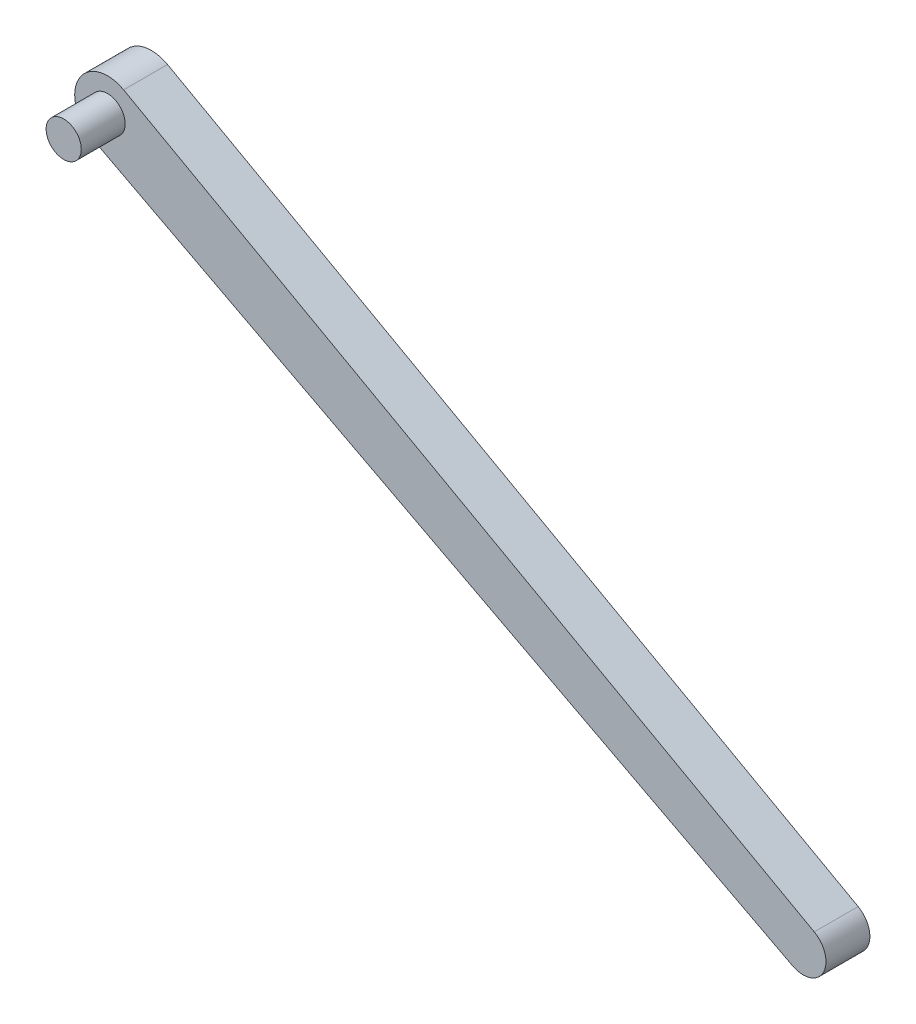
ISO-10303-21;
HEADER;
FILE_DESCRIPTION(('STEP AP214'),'2;1');
FILE_NAME('part.step','',(''),(''),'','','');
FILE_SCHEMA(('AUTOMOTIVE_DESIGN { 1 0 10303 214 1 1 1 1 }'));
ENDSEC;
DATA;
#1=APPLICATION_CONTEXT('core data for automotive mechanical design processes');
#2=APPLICATION_PROTOCOL_DEFINITION('international standard','automotive_design',2000,#1);
#3=PRODUCT_CONTEXT('',#1,'mechanical');
#4=PRODUCT('Part','Part','',(#3));
#5=PRODUCT_RELATED_PRODUCT_CATEGORY('part','',(#4));
#6=PRODUCT_DEFINITION_FORMATION('','',#4);
#7=PRODUCT_DEFINITION_CONTEXT('part definition',#1,'design');
#8=PRODUCT_DEFINITION('design','',#6,#7);
#9=PRODUCT_DEFINITION_SHAPE('','',#8);
#10=(LENGTH_UNIT() NAMED_UNIT(*) SI_UNIT(.MILLI.,.METRE.));
#11=(NAMED_UNIT(*) PLANE_ANGLE_UNIT() SI_UNIT($,.RADIAN.));
#12=(NAMED_UNIT(*) SI_UNIT($,.STERADIAN.) SOLID_ANGLE_UNIT());
#13=UNCERTAINTY_MEASURE_WITH_UNIT(LENGTH_MEASURE(1.E-05),#10,'distance_accuracy_value','');
#14=(GEOMETRIC_REPRESENTATION_CONTEXT(3) GLOBAL_UNCERTAINTY_ASSIGNED_CONTEXT((#13)) GLOBAL_UNIT_ASSIGNED_CONTEXT((#10,
#11,#12)) REPRESENTATION_CONTEXT('',''));
#15=CARTESIAN_POINT('',(0.,0.,0.));
#16=DIRECTION('',(0.,0.,1.));
#17=DIRECTION('',(1.,0.,0.));
#18=AXIS2_PLACEMENT_3D('',#15,#16,#17);
#19=CARTESIAN_POINT('',(0.,0.,-20.));
#20=DIRECTION('',(0.,0.,-1.));
#21=DIRECTION('',(1.,0.,0.));
#22=AXIS2_PLACEMENT_3D('',#19,#20,#21);
#23=PLANE('',#22);
#24=DIRECTION('',(0.874031845170728,-0.485868638242327,0.));
#25=VECTOR('',#24,1.);
#26=CARTESIAN_POINT('',(-43.5696519386731,-78.3776936399255,-20.));
#27=LINE('',#26,#25);
#28=CARTESIAN_POINT('',(-196.355985213183,6.55523883878045,-20.));
#29=VERTEX_POINT('',#28);
#30=CARTESIAN_POINT('',(-39.0430632462077,-80.8939949578273,-20.));
#31=VERTEX_POINT('',#30);
#32=EDGE_CURVE('E102',#29,#31,#27,.T.);
#33=ORIENTED_EDGE('',*,*,#32,.F.);
#34=CARTESIAN_POINT('',(-200.,0.,-20.));
#35=DIRECTION('',(0.,0.,1.));
#36=DIRECTION('',(1.,0.,0.));
#37=AXIS2_PLACEMENT_3D('',#34,#35,#36);
#38=CIRCLE('',#37,7.50000000000001);
#39=CARTESIAN_POINT('',(-203.47553922466,-6.64609863738495,-20.));
#40=VERTEX_POINT('',#39);
#41=EDGE_CURVE('E105',#29,#40,#38,.T.);
#42=ORIENTED_EDGE('',*,*,#41,.T.);
#43=DIRECTION('',(0.886146484984656,-0.463405229954668,0.));
#44=VECTOR('',#43,1.);
#45=CARTESIAN_POINT('',(-46.4244206545278,-88.775081766952,-20.));
#46=LINE('',#45,#44);
#47=CARTESIAN_POINT('',(-43.9821596482325,-90.0522481749993,-20.));
#48=VERTEX_POINT('',#47);
#49=EDGE_CURVE('E88',#40,#48,#46,.T.);
#50=ORIENTED_EDGE('',*,*,#49,.T.);
#51=CARTESIAN_POINT('',(-41.5710502933571,-85.441605174821,-20.));
#52=DIRECTION('',(0.,0.,1.));
#53=DIRECTION('',(1.,0.,0.));
#54=AXIS2_PLACEMENT_3D('',#51,#52,#53);
#55=CIRCLE('',#54,5.20302577316901);
#56=EDGE_CURVE('E97',#48,#31,#55,.T.);
#57=ORIENTED_EDGE('',*,*,#56,.T.);
#58=EDGE_LOOP('',(#33,#42,#50,#57));
#59=FACE_BOUND('',#58,.T.);
#60=CARTESIAN_POINT('',(-200.,0.,-20.));
#61=DIRECTION('',(0.,0.,1.));
#62=DIRECTION('',(1.,0.,0.));
#63=AXIS2_PLACEMENT_3D('',#60,#61,#62);
#64=CIRCLE('',#63,3.99999999999999);
#65=CARTESIAN_POINT('',(-196.,0.,-20.));
#66=VERTEX_POINT('',#65);
#67=EDGE_CURVE('E11',#66,#66,#64,.F.);
#68=ORIENTED_EDGE('',*,*,#67,.T.);
#69=EDGE_LOOP('',(#68));
#70=FACE_BOUND('',#69,.T.);
#71=ADVANCED_FACE('F35',(#59,#70),#23,.F.);
#72=CARTESIAN_POINT('',(-43.5696519386731,-78.3776936399255,-30.));
#73=DIRECTION('',(0.485868638242327,0.874031845170728,0.));
#74=DIRECTION('',(-0.874031845170728,0.485868638242327,0.));
#75=AXIS2_PLACEMENT_3D('',#72,#73,#74);
#76=PLANE('',#75);
#77=ORIENTED_EDGE('',*,*,#32,.T.);
#78=DIRECTION('',(0.,0.,1.));
#79=VECTOR('',#78,1.);
#80=CARTESIAN_POINT('',(-39.0430632462077,-80.8939949578273,-30.));
#81=LINE('',#80,#79);
#82=CARTESIAN_POINT('',(-39.0430632462077,-80.8939949578273,-30.));
#83=VERTEX_POINT('',#82);
#84=EDGE_CURVE('E72',#83,#31,#81,.T.);
#85=ORIENTED_EDGE('',*,*,#84,.F.);
#86=DIRECTION('',(0.874031845170728,-0.485868638242327,0.));
#87=VECTOR('',#86,1.);
#88=CARTESIAN_POINT('',(-43.5696519386731,-78.3776936399255,-30.));
#89=LINE('',#88,#87);
#90=CARTESIAN_POINT('',(-196.355985213183,6.55523883878045,-30.));
#91=VERTEX_POINT('',#90);
#92=EDGE_CURVE('E95',#91,#83,#89,.T.);
#93=ORIENTED_EDGE('',*,*,#92,.F.);
#94=DIRECTION('',(0.,0.,1.));
#95=VECTOR('',#94,1.);
#96=CARTESIAN_POINT('',(-196.355985213183,6.55523883878045,-30.));
#97=LINE('',#96,#95);
#98=EDGE_CURVE('E44',#91,#29,#97,.T.);
#99=ORIENTED_EDGE('',*,*,#98,.T.);
#100=EDGE_LOOP('',(#77,#85,#93,#99));
#101=FACE_BOUND('',#100,.T.);
#102=ADVANCED_FACE('F37',(#101),#76,.T.);
#103=CARTESIAN_POINT('',(-200.,0.,-30.));
#104=DIRECTION('',(0.,0.,1.));
#105=DIRECTION('',(-1.,0.,0.));
#106=AXIS2_PLACEMENT_3D('',#103,#104,#105);
#107=CYLINDRICAL_SURFACE('',#106,7.50000000000001);
#108=ORIENTED_EDGE('',*,*,#41,.F.);
#109=ORIENTED_EDGE('',*,*,#98,.F.);
#110=CARTESIAN_POINT('',(-200.,0.,-30.));
#111=DIRECTION('',(0.,0.,1.));
#112=DIRECTION('',(1.,0.,0.));
#113=AXIS2_PLACEMENT_3D('',#110,#111,#112);
#114=CIRCLE('',#113,7.50000000000001);
#115=CARTESIAN_POINT('',(-203.47553922466,-6.64609863738495,-30.));
#116=VERTEX_POINT('',#115);
#117=EDGE_CURVE('E79',#91,#116,#114,.T.);
#118=ORIENTED_EDGE('',*,*,#117,.T.);
#119=DIRECTION('',(0.,0.,1.));
#120=VECTOR('',#119,1.);
#121=CARTESIAN_POINT('',(-203.47553922466,-6.64609863738495,-30.));
#122=LINE('',#121,#120);
#123=EDGE_CURVE('E85',#116,#40,#122,.T.);
#124=ORIENTED_EDGE('',*,*,#123,.T.);
#125=EDGE_LOOP('',(#108,#109,#118,#124));
#126=FACE_BOUND('',#125,.T.);
#127=ADVANCED_FACE('F93',(#126),#107,.T.);
#128=CARTESIAN_POINT('',(-46.4244206545278,-88.775081766952,-30.));
#129=DIRECTION('',(0.463405229954668,0.886146484984656,0.));
#130=DIRECTION('',(-0.886146484984656,0.463405229954668,0.));
#131=AXIS2_PLACEMENT_3D('',#128,#129,#130);
#132=PLANE('',#131);
#133=ORIENTED_EDGE('',*,*,#49,.F.);
#134=ORIENTED_EDGE('',*,*,#123,.F.);
#135=DIRECTION('',(0.886146484984656,-0.463405229954668,0.));
#136=VECTOR('',#135,1.);
#137=CARTESIAN_POINT('',(-46.4244206545278,-88.775081766952,-30.));
#138=LINE('',#137,#136);
#139=CARTESIAN_POINT('',(-43.9821596482325,-90.0522481749993,-30.));
#140=VERTEX_POINT('',#139);
#141=EDGE_CURVE('E81',#116,#140,#138,.T.);
#142=ORIENTED_EDGE('',*,*,#141,.T.);
#143=DIRECTION('',(0.,0.,1.));
#144=VECTOR('',#143,1.);
#145=CARTESIAN_POINT('',(-43.9821596482325,-90.0522481749993,-30.));
#146=LINE('',#145,#144);
#147=EDGE_CURVE('E68',#140,#48,#146,.T.);
#148=ORIENTED_EDGE('',*,*,#147,.T.);
#149=EDGE_LOOP('',(#133,#134,#142,#148));
#150=FACE_BOUND('',#149,.T.);
#151=ADVANCED_FACE('F86',(#150),#132,.F.);
#152=CARTESIAN_POINT('',(-41.5710502933571,-85.441605174821,-30.));
#153=DIRECTION('',(0.,0.,1.));
#154=DIRECTION('',(-1.,0.,0.));
#155=AXIS2_PLACEMENT_3D('',#152,#153,#154);
#156=CYLINDRICAL_SURFACE('',#155,5.20302577316901);
#157=ORIENTED_EDGE('',*,*,#56,.F.);
#158=ORIENTED_EDGE('',*,*,#147,.F.);
#159=CARTESIAN_POINT('',(-41.5710502933571,-85.441605174821,-30.));
#160=DIRECTION('',(0.,0.,1.));
#161=DIRECTION('',(1.,0.,0.));
#162=AXIS2_PLACEMENT_3D('',#159,#160,#161);
#163=CIRCLE('',#162,5.20302577316901);
#164=EDGE_CURVE('E52',#140,#83,#163,.T.);
#165=ORIENTED_EDGE('',*,*,#164,.T.);
#166=ORIENTED_EDGE('',*,*,#84,.T.);
#167=EDGE_LOOP('',(#157,#158,#165,#166));
#168=FACE_BOUND('',#167,.T.);
#169=ADVANCED_FACE('F115',(#168),#156,.T.);
#170=CARTESIAN_POINT('',(0.,0.,-30.));
#171=DIRECTION('',(0.,0.,-1.));
#172=DIRECTION('',(1.,0.,0.));
#173=AXIS2_PLACEMENT_3D('',#170,#171,#172);
#174=PLANE('',#173);
#175=ORIENTED_EDGE('',*,*,#92,.T.);
#176=ORIENTED_EDGE('',*,*,#164,.F.);
#177=ORIENTED_EDGE('',*,*,#141,.F.);
#178=ORIENTED_EDGE('',*,*,#117,.F.);
#179=EDGE_LOOP('',(#175,#176,#177,#178));
#180=FACE_BOUND('',#179,.T.);
#181=ADVANCED_FACE('F83',(#180),#174,.T.);
#182=CARTESIAN_POINT('',(-200.,0.,-10.));
#183=DIRECTION('',(0.,0.,-1.));
#184=DIRECTION('',(1.,0.,0.));
#185=AXIS2_PLACEMENT_3D('',#182,#183,#184);
#186=CYLINDRICAL_SURFACE('',#185,3.99999999999999);
#187=CARTESIAN_POINT('',(-200.,0.,-10.));
#188=DIRECTION('',(0.,0.,-1.));
#189=DIRECTION('',(-1.,0.,0.));
#190=AXIS2_PLACEMENT_3D('',#187,#188,#189);
#191=CIRCLE('',#190,3.99999999999999);
#192=CARTESIAN_POINT('',(-204.,0.,-10.));
#193=VERTEX_POINT('',#192);
#194=EDGE_CURVE('E106',#193,#193,#191,.T.);
#195=ORIENTED_EDGE('',*,*,#194,.T.);
#196=EDGE_LOOP('',(#195));
#197=FACE_BOUND('',#196,.T.);
#198=ORIENTED_EDGE('',*,*,#67,.F.);
#199=EDGE_LOOP('',(#198));
#200=FACE_BOUND('',#199,.T.);
#201=ADVANCED_FACE('F122',(#197,#200),#186,.T.);
#202=CARTESIAN_POINT('',(-200.,0.,-10.));
#203=DIRECTION('',(0.,0.,1.));
#204=DIRECTION('',(-1.,0.,0.));
#205=AXIS2_PLACEMENT_3D('',#202,#203,#204);
#206=PLANE('',#205);
#207=ORIENTED_EDGE('',*,*,#194,.F.);
#208=EDGE_LOOP('',(#207));
#209=FACE_BOUND('',#208,.T.);
#210=ADVANCED_FACE('F133',(#209),#206,.T.);
#211=CLOSED_SHELL('',(#71,#102,#127,#151,#169,#181,#201,#210));
#212=MANIFOLD_SOLID_BREP('B2',#211);
#213=ADVANCED_BREP_SHAPE_REPRESENTATION('',(#18,#212),#14);
#214=SHAPE_DEFINITION_REPRESENTATION(#9,#213);
ENDSEC;
END-ISO-10303-21;
